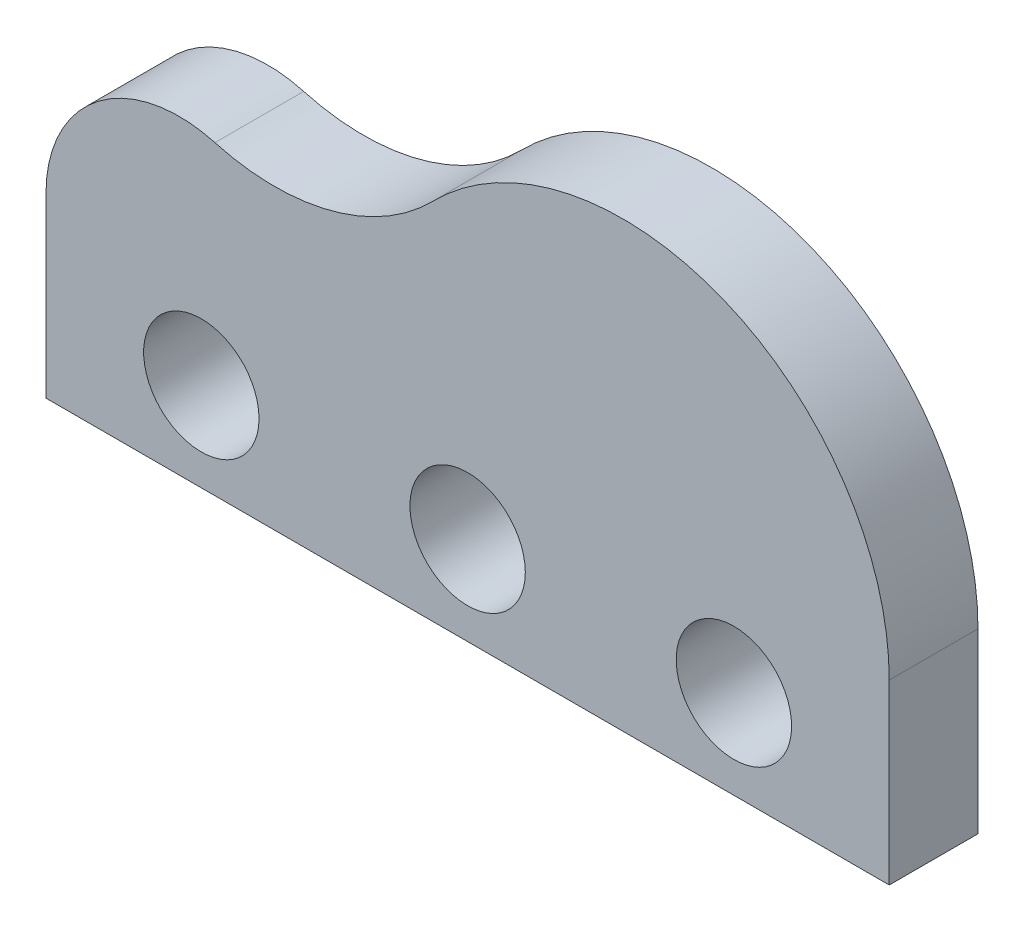
ISO-10303-21;
HEADER;
FILE_DESCRIPTION(('STEP AP214'),'2;1');
FILE_NAME('part.step','',(''),(''),'','','');
FILE_SCHEMA(('AUTOMOTIVE_DESIGN { 1 0 10303 214 1 1 1 1 }'));
ENDSEC;
DATA;
#1=APPLICATION_CONTEXT('core data for automotive mechanical design processes');
#2=APPLICATION_PROTOCOL_DEFINITION('international standard','automotive_design',2000,#1);
#3=PRODUCT_CONTEXT('',#1,'mechanical');
#4=PRODUCT('Part','Part','',(#3));
#5=PRODUCT_RELATED_PRODUCT_CATEGORY('part','',(#4));
#6=PRODUCT_DEFINITION_FORMATION('','',#4);
#7=PRODUCT_DEFINITION_CONTEXT('part definition',#1,'design');
#8=PRODUCT_DEFINITION('design','',#6,#7);
#9=PRODUCT_DEFINITION_SHAPE('','',#8);
#10=(LENGTH_UNIT() NAMED_UNIT(*) SI_UNIT(.MILLI.,.METRE.));
#11=(NAMED_UNIT(*) PLANE_ANGLE_UNIT() SI_UNIT($,.RADIAN.));
#12=(NAMED_UNIT(*) SI_UNIT($,.STERADIAN.) SOLID_ANGLE_UNIT());
#13=UNCERTAINTY_MEASURE_WITH_UNIT(LENGTH_MEASURE(1.E-05),#10,'distance_accuracy_value','');
#14=(GEOMETRIC_REPRESENTATION_CONTEXT(3) GLOBAL_UNCERTAINTY_ASSIGNED_CONTEXT((#13)) GLOBAL_UNIT_ASSIGNED_CONTEXT((#10,
#11,#12)) REPRESENTATION_CONTEXT('',''));
#15=CARTESIAN_POINT('',(0.,0.,0.));
#16=DIRECTION('',(0.,0.,1.));
#17=DIRECTION('',(1.,0.,0.));
#18=AXIS2_PLACEMENT_3D('',#15,#16,#17);
#19=CARTESIAN_POINT('',(15.,20.,5.));
#20=DIRECTION('',(0.,0.,-1.));
#21=DIRECTION('',(-1.,0.,0.));
#22=AXIS2_PLACEMENT_3D('',#19,#20,#21);
#23=PLANE('',#22);
#24=CARTESIAN_POINT('',(15.,20.,5.));
#25=DIRECTION('',(0.,0.,1.));
#26=DIRECTION('',(-1.,0.,0.));
#27=AXIS2_PLACEMENT_3D('',#24,#25,#26);
#28=CIRCLE('',#27,15.);
#29=CARTESIAN_POINT('',(19.03125,34.4481494814215,5.));
#30=VERTEX_POINT('',#29);
#31=CARTESIAN_POINT('',(0.,20.,5.));
#32=VERTEX_POINT('',#31);
#33=EDGE_CURVE('E152',#30,#32,#28,.T.);
#34=ORIENTED_EDGE('',*,*,#33,.T.);
#35=DIRECTION('',(0.,-1.,0.));
#36=VECTOR('',#35,1.);
#37=CARTESIAN_POINT('',(0.,20.,5.));
#38=LINE('',#37,#36);
#39=CARTESIAN_POINT('',(0.,0.,5.));
#40=VERTEX_POINT('',#39);
#41=EDGE_CURVE('E100',#32,#40,#38,.T.);
#42=ORIENTED_EDGE('',*,*,#41,.T.);
#43=DIRECTION('',(1.,0.,0.));
#44=VECTOR('',#43,1.);
#45=CARTESIAN_POINT('',(0.,0.,5.));
#46=LINE('',#45,#44);
#47=CARTESIAN_POINT('',(95.,0.,5.));
#48=VERTEX_POINT('',#47);
#49=EDGE_CURVE('E113',#40,#48,#46,.T.);
#50=ORIENTED_EDGE('',*,*,#49,.T.);
#51=DIRECTION('',(0.,1.,0.));
#52=VECTOR('',#51,1.);
#53=CARTESIAN_POINT('',(95.,0.,5.));
#54=LINE('',#53,#52);
#55=CARTESIAN_POINT('',(95.,20.,5.));
#56=VERTEX_POINT('',#55);
#57=EDGE_CURVE('E107',#48,#56,#54,.T.);
#58=ORIENTED_EDGE('',*,*,#57,.T.);
#59=CARTESIAN_POINT('',(65.,20.,5.));
#60=DIRECTION('',(0.,0.,1.));
#61=DIRECTION('',(-1.,0.,0.));
#62=AXIS2_PLACEMENT_3D('',#59,#60,#61);
#63=CIRCLE('',#62,30.);
#64=CARTESIAN_POINT('',(43.5909090909091,41.0154901547949,5.));
#65=VERTEX_POINT('',#64);
#66=EDGE_CURVE('E111',#56,#65,#63,.T.);
#67=ORIENTED_EDGE('',*,*,#66,.T.);
#68=CARTESIAN_POINT('',(25.75,58.528398617124,5.));
#69=DIRECTION('',(0.,0.,-1.));
#70=DIRECTION('',(1.,0.,0.));
#71=AXIS2_PLACEMENT_3D('',#68,#69,#70);
#72=CIRCLE('',#71,25.);
#73=EDGE_CURVE('E63',#65,#30,#72,.T.);
#74=ORIENTED_EDGE('',*,*,#73,.T.);
#75=EDGE_LOOP('',(#34,#42,#50,#58,#67,#74));
#76=FACE_BOUND('',#75,.T.);
#77=CARTESIAN_POINT('',(47.5,10.,5.));
#78=DIRECTION('',(0.,0.,1.));
#79=DIRECTION('',(1.,0.,0.));
#80=AXIS2_PLACEMENT_3D('',#77,#78,#79);
#81=CIRCLE('',#80,6.5);
#82=CARTESIAN_POINT('',(54.,10.,5.));
#83=VERTEX_POINT('',#82);
#84=EDGE_CURVE('E140',#83,#83,#81,.T.);
#85=ORIENTED_EDGE('',*,*,#84,.F.);
#86=EDGE_LOOP('',(#85));
#87=FACE_BOUND('',#86,.T.);
#88=CARTESIAN_POINT('',(77.5,10.,5.));
#89=DIRECTION('',(0.,0.,1.));
#90=DIRECTION('',(1.,0.,0.));
#91=AXIS2_PLACEMENT_3D('',#88,#89,#90);
#92=CIRCLE('',#91,6.5);
#93=CARTESIAN_POINT('',(84.,10.,5.));
#94=VERTEX_POINT('',#93);
#95=EDGE_CURVE('E212',#94,#94,#92,.T.);
#96=ORIENTED_EDGE('',*,*,#95,.F.);
#97=EDGE_LOOP('',(#96));
#98=FACE_BOUND('',#97,.T.);
#99=CARTESIAN_POINT('',(17.5,10.,5.));
#100=DIRECTION('',(0.,0.,1.));
#101=DIRECTION('',(1.,0.,0.));
#102=AXIS2_PLACEMENT_3D('',#99,#100,#101);
#103=CIRCLE('',#102,6.5);
#104=CARTESIAN_POINT('',(24.,10.,5.));
#105=VERTEX_POINT('',#104);
#106=EDGE_CURVE('E201',#105,#105,#103,.T.);
#107=ORIENTED_EDGE('',*,*,#106,.F.);
#108=EDGE_LOOP('',(#107));
#109=FACE_BOUND('',#108,.T.);
#110=ADVANCED_FACE('F45',(#76,#87,#98,#109),#23,.F.);
#111=CARTESIAN_POINT('',(15.,20.,-5.));
#112=DIRECTION('',(0.,0.,-1.));
#113=DIRECTION('',(-1.,0.,0.));
#114=AXIS2_PLACEMENT_3D('',#111,#112,#113);
#115=PLANE('',#114);
#116=CARTESIAN_POINT('',(77.5,10.,-5.));
#117=DIRECTION('',(0.,0.,1.));
#118=DIRECTION('',(1.,0.,0.));
#119=AXIS2_PLACEMENT_3D('',#116,#117,#118);
#120=CIRCLE('',#119,6.5);
#121=CARTESIAN_POINT('',(84.,10.,-5.));
#122=VERTEX_POINT('',#121);
#123=EDGE_CURVE('E209',#122,#122,#120,.T.);
#124=ORIENTED_EDGE('',*,*,#123,.T.);
#125=EDGE_LOOP('',(#124));
#126=FACE_BOUND('',#125,.T.);
#127=CARTESIAN_POINT('',(15.,20.,-5.));
#128=DIRECTION('',(0.,0.,1.));
#129=DIRECTION('',(-1.,0.,0.));
#130=AXIS2_PLACEMENT_3D('',#127,#128,#129);
#131=CIRCLE('',#130,15.);
#132=CARTESIAN_POINT('',(19.03125,34.4481494814215,-5.));
#133=VERTEX_POINT('',#132);
#134=CARTESIAN_POINT('',(0.,20.,-5.));
#135=VERTEX_POINT('',#134);
#136=EDGE_CURVE('E135',#133,#135,#131,.T.);
#137=ORIENTED_EDGE('',*,*,#136,.F.);
#138=CARTESIAN_POINT('',(25.75,58.528398617124,-5.));
#139=DIRECTION('',(0.,0.,-1.));
#140=DIRECTION('',(1.,0.,0.));
#141=AXIS2_PLACEMENT_3D('',#138,#139,#140);
#142=CIRCLE('',#141,25.);
#143=CARTESIAN_POINT('',(43.5909090909091,41.0154901547949,-5.));
#144=VERTEX_POINT('',#143);
#145=EDGE_CURVE('E92',#144,#133,#142,.T.);
#146=ORIENTED_EDGE('',*,*,#145,.F.);
#147=CARTESIAN_POINT('',(65.,20.,-5.));
#148=DIRECTION('',(0.,0.,1.));
#149=DIRECTION('',(-1.,0.,0.));
#150=AXIS2_PLACEMENT_3D('',#147,#148,#149);
#151=CIRCLE('',#150,30.);
#152=CARTESIAN_POINT('',(95.,20.,-5.));
#153=VERTEX_POINT('',#152);
#154=EDGE_CURVE('E86',#153,#144,#151,.T.);
#155=ORIENTED_EDGE('',*,*,#154,.F.);
#156=DIRECTION('',(0.,1.,0.));
#157=VECTOR('',#156,1.);
#158=CARTESIAN_POINT('',(95.,0.,-5.));
#159=LINE('',#158,#157);
#160=CARTESIAN_POINT('',(95.,0.,-5.));
#161=VERTEX_POINT('',#160);
#162=EDGE_CURVE('E122',#161,#153,#159,.T.);
#163=ORIENTED_EDGE('',*,*,#162,.F.);
#164=DIRECTION('',(1.,0.,0.));
#165=VECTOR('',#164,1.);
#166=CARTESIAN_POINT('',(0.,0.,-5.));
#167=LINE('',#166,#165);
#168=CARTESIAN_POINT('',(0.,0.,-5.));
#169=VERTEX_POINT('',#168);
#170=EDGE_CURVE('E143',#169,#161,#167,.T.);
#171=ORIENTED_EDGE('',*,*,#170,.F.);
#172=DIRECTION('',(0.,-1.,0.));
#173=VECTOR('',#172,1.);
#174=CARTESIAN_POINT('',(0.,20.,-5.));
#175=LINE('',#174,#173);
#176=EDGE_CURVE('E139',#135,#169,#175,.T.);
#177=ORIENTED_EDGE('',*,*,#176,.F.);
#178=EDGE_LOOP('',(#137,#146,#155,#163,#171,#177));
#179=FACE_BOUND('',#178,.T.);
#180=CARTESIAN_POINT('',(47.5,10.,-5.));
#181=DIRECTION('',(0.,0.,1.));
#182=DIRECTION('',(1.,0.,0.));
#183=AXIS2_PLACEMENT_3D('',#180,#181,#182);
#184=CIRCLE('',#183,6.5);
#185=CARTESIAN_POINT('',(54.,10.,-5.));
#186=VERTEX_POINT('',#185);
#187=EDGE_CURVE('E216',#186,#186,#184,.T.);
#188=ORIENTED_EDGE('',*,*,#187,.T.);
#189=EDGE_LOOP('',(#188));
#190=FACE_BOUND('',#189,.T.);
#191=CARTESIAN_POINT('',(17.5,10.,-5.));
#192=DIRECTION('',(0.,0.,1.));
#193=DIRECTION('',(1.,0.,0.));
#194=AXIS2_PLACEMENT_3D('',#191,#192,#193);
#195=CIRCLE('',#194,6.5);
#196=CARTESIAN_POINT('',(24.,10.,-5.));
#197=VERTEX_POINT('',#196);
#198=EDGE_CURVE('E204',#197,#197,#195,.T.);
#199=ORIENTED_EDGE('',*,*,#198,.T.);
#200=EDGE_LOOP('',(#199));
#201=FACE_BOUND('',#200,.T.);
#202=ADVANCED_FACE('F165',(#126,#179,#190,#201),#115,.T.);
#203=CARTESIAN_POINT('',(15.,20.,5.));
#204=DIRECTION('',(0.,0.,-1.));
#205=DIRECTION('',(-1.,0.,0.));
#206=AXIS2_PLACEMENT_3D('',#203,#204,#205);
#207=CYLINDRICAL_SURFACE('',#206,15.);
#208=ORIENTED_EDGE('',*,*,#136,.T.);
#209=DIRECTION('',(0.,0.,-1.));
#210=VECTOR('',#209,1.);
#211=CARTESIAN_POINT('',(0.,20.,5.));
#212=LINE('',#211,#210);
#213=EDGE_CURVE('E11',#32,#135,#212,.T.);
#214=ORIENTED_EDGE('',*,*,#213,.F.);
#215=ORIENTED_EDGE('',*,*,#33,.F.);
#216=DIRECTION('',(0.,0.,-1.));
#217=VECTOR('',#216,1.);
#218=CARTESIAN_POINT('',(19.03125,34.4481494814215,5.));
#219=LINE('',#218,#217);
#220=EDGE_CURVE('E131',#30,#133,#219,.T.);
#221=ORIENTED_EDGE('',*,*,#220,.T.);
#222=EDGE_LOOP('',(#208,#214,#215,#221));
#223=FACE_BOUND('',#222,.T.);
#224=ADVANCED_FACE('F47',(#223),#207,.T.);
#225=CARTESIAN_POINT('',(0.,20.,5.));
#226=DIRECTION('',(1.,0.,0.));
#227=DIRECTION('',(0.,1.,0.));
#228=AXIS2_PLACEMENT_3D('',#225,#226,#227);
#229=PLANE('',#228);
#230=ORIENTED_EDGE('',*,*,#176,.T.);
#231=DIRECTION('',(0.,0.,-1.));
#232=VECTOR('',#231,1.);
#233=CARTESIAN_POINT('',(0.,0.,5.));
#234=LINE('',#233,#232);
#235=EDGE_CURVE('E55',#40,#169,#234,.T.);
#236=ORIENTED_EDGE('',*,*,#235,.F.);
#237=ORIENTED_EDGE('',*,*,#41,.F.);
#238=ORIENTED_EDGE('',*,*,#213,.T.);
#239=EDGE_LOOP('',(#230,#236,#237,#238));
#240=FACE_BOUND('',#239,.T.);
#241=ADVANCED_FACE('F276',(#240),#229,.F.);
#242=CARTESIAN_POINT('',(0.,0.,5.));
#243=DIRECTION('',(0.,1.,0.));
#244=DIRECTION('',(0.,0.,1.));
#245=AXIS2_PLACEMENT_3D('',#242,#243,#244);
#246=PLANE('',#245);
#247=ORIENTED_EDGE('',*,*,#170,.T.);
#248=DIRECTION('',(0.,0.,-1.));
#249=VECTOR('',#248,1.);
#250=CARTESIAN_POINT('',(95.,0.,5.));
#251=LINE('',#250,#249);
#252=EDGE_CURVE('E124',#48,#161,#251,.T.);
#253=ORIENTED_EDGE('',*,*,#252,.F.);
#254=ORIENTED_EDGE('',*,*,#49,.F.);
#255=ORIENTED_EDGE('',*,*,#235,.T.);
#256=EDGE_LOOP('',(#247,#253,#254,#255));
#257=FACE_BOUND('',#256,.T.);
#258=ADVANCED_FACE('F162',(#257),#246,.F.);
#259=CARTESIAN_POINT('',(95.,0.,5.));
#260=DIRECTION('',(-1.,0.,0.));
#261=DIRECTION('',(0.,0.,1.));
#262=AXIS2_PLACEMENT_3D('',#259,#260,#261);
#263=PLANE('',#262);
#264=ORIENTED_EDGE('',*,*,#162,.T.);
#265=DIRECTION('',(0.,0.,-1.));
#266=VECTOR('',#265,1.);
#267=CARTESIAN_POINT('',(95.,20.,5.));
#268=LINE('',#267,#266);
#269=EDGE_CURVE('E119',#56,#153,#268,.T.);
#270=ORIENTED_EDGE('',*,*,#269,.F.);
#271=ORIENTED_EDGE('',*,*,#57,.F.);
#272=ORIENTED_EDGE('',*,*,#252,.T.);
#273=EDGE_LOOP('',(#264,#270,#271,#272));
#274=FACE_BOUND('',#273,.T.);
#275=ADVANCED_FACE('F120',(#274),#263,.F.);
#276=CARTESIAN_POINT('',(65.,20.,5.));
#277=DIRECTION('',(0.,0.,-1.));
#278=DIRECTION('',(-1.,0.,0.));
#279=AXIS2_PLACEMENT_3D('',#276,#277,#278);
#280=CYLINDRICAL_SURFACE('',#279,30.);
#281=ORIENTED_EDGE('',*,*,#154,.T.);
#282=DIRECTION('',(0.,0.,-1.));
#283=VECTOR('',#282,1.);
#284=CARTESIAN_POINT('',(43.5909090909091,41.0154901547949,5.));
#285=LINE('',#284,#283);
#286=EDGE_CURVE('E125',#65,#144,#285,.T.);
#287=ORIENTED_EDGE('',*,*,#286,.F.);
#288=ORIENTED_EDGE('',*,*,#66,.F.);
#289=ORIENTED_EDGE('',*,*,#269,.T.);
#290=EDGE_LOOP('',(#281,#287,#288,#289));
#291=FACE_BOUND('',#290,.T.);
#292=ADVANCED_FACE('F127',(#291),#280,.T.);
#293=CARTESIAN_POINT('',(25.75,58.528398617124,5.));
#294=DIRECTION('',(0.,0.,-1.));
#295=DIRECTION('',(-1.,0.,0.));
#296=AXIS2_PLACEMENT_3D('',#293,#294,#295);
#297=CYLINDRICAL_SURFACE('',#296,25.);
#298=ORIENTED_EDGE('',*,*,#145,.T.);
#299=ORIENTED_EDGE('',*,*,#220,.F.);
#300=ORIENTED_EDGE('',*,*,#73,.F.);
#301=ORIENTED_EDGE('',*,*,#286,.T.);
#302=EDGE_LOOP('',(#298,#299,#300,#301));
#303=FACE_BOUND('',#302,.T.);
#304=ADVANCED_FACE('F170',(#303),#297,.F.);
#305=CARTESIAN_POINT('',(47.5,10.,5.));
#306=DIRECTION('',(0.,0.,-1.));
#307=DIRECTION('',(-1.,0.,0.));
#308=AXIS2_PLACEMENT_3D('',#305,#306,#307);
#309=CYLINDRICAL_SURFACE('',#308,6.5);
#310=ORIENTED_EDGE('',*,*,#84,.T.);
#311=EDGE_LOOP('',(#310));
#312=FACE_BOUND('',#311,.T.);
#313=ORIENTED_EDGE('',*,*,#187,.F.);
#314=EDGE_LOOP('',(#313));
#315=FACE_BOUND('',#314,.T.);
#316=ADVANCED_FACE('F172',(#312,#315),#309,.F.);
#317=CARTESIAN_POINT('',(77.5,10.,5.));
#318=DIRECTION('',(0.,0.,-1.));
#319=DIRECTION('',(-1.,0.,0.));
#320=AXIS2_PLACEMENT_3D('',#317,#318,#319);
#321=CYLINDRICAL_SURFACE('',#320,6.5);
#322=ORIENTED_EDGE('',*,*,#95,.T.);
#323=EDGE_LOOP('',(#322));
#324=FACE_BOUND('',#323,.T.);
#325=ORIENTED_EDGE('',*,*,#123,.F.);
#326=EDGE_LOOP('',(#325));
#327=FACE_BOUND('',#326,.T.);
#328=ADVANCED_FACE('F178',(#324,#327),#321,.F.);
#329=CARTESIAN_POINT('',(17.5,10.,5.));
#330=DIRECTION('',(0.,0.,-1.));
#331=DIRECTION('',(-1.,0.,0.));
#332=AXIS2_PLACEMENT_3D('',#329,#330,#331);
#333=CYLINDRICAL_SURFACE('',#332,6.5);
#334=ORIENTED_EDGE('',*,*,#106,.T.);
#335=EDGE_LOOP('',(#334));
#336=FACE_BOUND('',#335,.T.);
#337=ORIENTED_EDGE('',*,*,#198,.F.);
#338=EDGE_LOOP('',(#337));
#339=FACE_BOUND('',#338,.T.);
#340=ADVANCED_FACE('F192',(#336,#339),#333,.F.);
#341=CLOSED_SHELL('',(#110,#202,#224,#241,#258,#275,#292,#304,#316,#328,#340));
#342=MANIFOLD_SOLID_BREP('B2',#341);
#343=ADVANCED_BREP_SHAPE_REPRESENTATION('',(#18,#342),#14);
#344=SHAPE_DEFINITION_REPRESENTATION(#9,#343);
ENDSEC;
END-ISO-10303-21;
